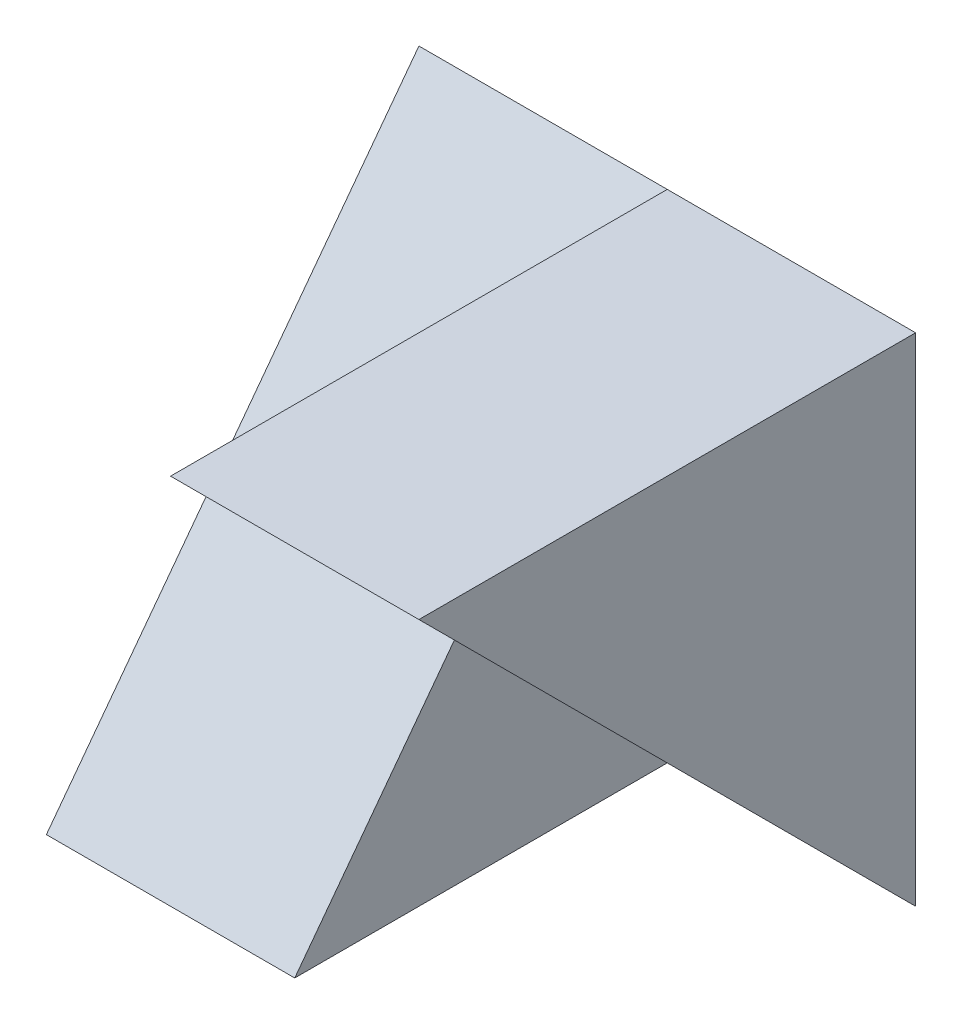
ISO-10303-21;
HEADER;
FILE_DESCRIPTION(('STEP AP214'),'2;1');
FILE_NAME('part.step','',(''),(''),'','','');
FILE_SCHEMA(('AUTOMOTIVE_DESIGN { 1 0 10303 214 1 1 1 1 }'));
ENDSEC;
DATA;
#1=APPLICATION_CONTEXT('core data for automotive mechanical design processes');
#2=APPLICATION_PROTOCOL_DEFINITION('international standard','automotive_design',2000,#1);
#3=PRODUCT_CONTEXT('',#1,'mechanical');
#4=PRODUCT('Part','Part','',(#3));
#5=PRODUCT_RELATED_PRODUCT_CATEGORY('part','',(#4));
#6=PRODUCT_DEFINITION_FORMATION('','',#4);
#7=PRODUCT_DEFINITION_CONTEXT('part definition',#1,'design');
#8=PRODUCT_DEFINITION('design','',#6,#7);
#9=PRODUCT_DEFINITION_SHAPE('','',#8);
#10=(LENGTH_UNIT() NAMED_UNIT(*) SI_UNIT(.MILLI.,.METRE.));
#11=(NAMED_UNIT(*) PLANE_ANGLE_UNIT() SI_UNIT($,.RADIAN.));
#12=(NAMED_UNIT(*) SI_UNIT($,.STERADIAN.) SOLID_ANGLE_UNIT());
#13=UNCERTAINTY_MEASURE_WITH_UNIT(LENGTH_MEASURE(1.E-05),#10,'distance_accuracy_value','');
#14=(GEOMETRIC_REPRESENTATION_CONTEXT(3) GLOBAL_UNCERTAINTY_ASSIGNED_CONTEXT((#13)) GLOBAL_UNIT_ASSIGNED_CONTEXT((#10,
#11,#12)) REPRESENTATION_CONTEXT('',''));
#15=CARTESIAN_POINT('',(0.,0.,0.));
#16=DIRECTION('',(0.,0.,1.));
#17=DIRECTION('',(1.,0.,0.));
#18=AXIS2_PLACEMENT_3D('',#15,#16,#17);
#19=CARTESIAN_POINT('',(2.,4.,0.));
#20=DIRECTION('',(0.,-1.,0.));
#21=DIRECTION('',(0.,0.,-1.));
#22=AXIS2_PLACEMENT_3D('',#19,#20,#21);
#23=PLANE('',#22);
#24=DIRECTION('',(-1.,0.,0.));
#25=VECTOR('',#24,1.);
#26=CARTESIAN_POINT('',(2.,4.,-4.));
#27=LINE('',#26,#25);
#28=CARTESIAN_POINT('',(2.,4.,-4.));
#29=VERTEX_POINT('',#28);
#30=CARTESIAN_POINT('',(0.,4.,-4.));
#31=VERTEX_POINT('',#30);
#32=EDGE_CURVE('E108',#29,#31,#27,.T.);
#33=ORIENTED_EDGE('',*,*,#32,.T.);
#34=DIRECTION('',(0.,0.,1.));
#35=VECTOR('',#34,1.);
#36=CARTESIAN_POINT('',(0.,4.,0.));
#37=LINE('',#36,#35);
#38=CARTESIAN_POINT('',(0.,4.,0.));
#39=VERTEX_POINT('',#38);
#40=EDGE_CURVE('E88',#31,#39,#37,.T.);
#41=ORIENTED_EDGE('',*,*,#40,.T.);
#42=DIRECTION('',(-1.,0.,0.));
#43=VECTOR('',#42,1.);
#44=CARTESIAN_POINT('',(2.,4.,0.));
#45=LINE('',#44,#43);
#46=CARTESIAN_POINT('',(2.,4.,0.));
#47=VERTEX_POINT('',#46);
#48=EDGE_CURVE('E115',#47,#39,#45,.T.);
#49=ORIENTED_EDGE('',*,*,#48,.F.);
#50=DIRECTION('',(0.,0.,1.));
#51=VECTOR('',#50,1.);
#52=CARTESIAN_POINT('',(2.,4.,0.));
#53=LINE('',#52,#51);
#54=EDGE_CURVE('E114',#29,#47,#53,.T.);
#55=ORIENTED_EDGE('',*,*,#54,.F.);
#56=EDGE_LOOP('',(#33,#41,#49,#55));
#57=FACE_BOUND('',#56,.T.);
#58=ADVANCED_FACE('F33',(#57),#23,.F.);
#59=CARTESIAN_POINT('',(2.,0.,0.));
#60=DIRECTION('',(0.,1.,0.));
#61=DIRECTION('',(0.,0.,1.));
#62=AXIS2_PLACEMENT_3D('',#59,#60,#61);
#63=PLANE('',#62);
#64=DIRECTION('',(0.,0.,-1.));
#65=VECTOR('',#64,1.);
#66=CARTESIAN_POINT('',(0.,0.,0.));
#67=LINE('',#66,#65);
#68=CARTESIAN_POINT('',(0.,0.,-1.));
#69=VERTEX_POINT('',#68);
#70=CARTESIAN_POINT('',(0.,0.,-4.));
#71=VERTEX_POINT('',#70);
#72=EDGE_CURVE('E129',#69,#71,#67,.T.);
#73=ORIENTED_EDGE('',*,*,#72,.F.);
#74=DIRECTION('',(1.,0.,0.));
#75=VECTOR('',#74,1.);
#76=CARTESIAN_POINT('',(-2.,0.,-1.));
#77=LINE('',#76,#75);
#78=CARTESIAN_POINT('',(-2.,0.,-1.));
#79=VERTEX_POINT('',#78);
#80=EDGE_CURVE('E96',#79,#69,#77,.T.);
#81=ORIENTED_EDGE('',*,*,#80,.F.);
#82=DIRECTION('',(0.,0.,1.));
#83=VECTOR('',#82,1.);
#84=CARTESIAN_POINT('',(-2.,0.,-4.));
#85=LINE('',#84,#83);
#86=CARTESIAN_POINT('',(-2.,0.,-4.));
#87=VERTEX_POINT('',#86);
#88=EDGE_CURVE('E125',#87,#79,#85,.T.);
#89=ORIENTED_EDGE('',*,*,#88,.F.);
#90=DIRECTION('',(-1.,0.,0.));
#91=VECTOR('',#90,1.);
#92=CARTESIAN_POINT('',(2.,0.,-4.));
#93=LINE('',#92,#91);
#94=EDGE_CURVE('E43',#71,#87,#93,.T.);
#95=ORIENTED_EDGE('',*,*,#94,.F.);
#96=EDGE_LOOP('',(#73,#81,#89,#95));
#97=FACE_BOUND('',#96,.T.);
#98=ADVANCED_FACE('F35',(#97),#63,.F.);
#99=CARTESIAN_POINT('',(2.,0.,-4.));
#100=DIRECTION('',(0.,0.,1.));
#101=DIRECTION('',(1.,0.,0.));
#102=AXIS2_PLACEMENT_3D('',#99,#100,#101);
#103=PLANE('',#102);
#104=CARTESIAN_POINT('',(2.,0.,-4.));
#105=VERTEX_POINT('',#104);
#106=EDGE_CURVE('E11',#105,#71,#93,.T.);
#107=ORIENTED_EDGE('',*,*,#106,.T.);
#108=ORIENTED_EDGE('',*,*,#94,.T.);
#109=DIRECTION('',(0.,-1.,0.));
#110=VECTOR('',#109,1.);
#111=CARTESIAN_POINT('',(-2.,4.,-4.));
#112=LINE('',#111,#110);
#113=CARTESIAN_POINT('',(-2.,4.,-4.));
#114=VERTEX_POINT('',#113);
#115=EDGE_CURVE('E111',#114,#87,#112,.T.);
#116=ORIENTED_EDGE('',*,*,#115,.F.);
#117=DIRECTION('',(-1.,0.,0.));
#118=VECTOR('',#117,1.);
#119=CARTESIAN_POINT('',(0.,4.,-4.));
#120=LINE('',#119,#118);
#121=EDGE_CURVE('E101',#31,#114,#120,.T.);
#122=ORIENTED_EDGE('',*,*,#121,.F.);
#123=ORIENTED_EDGE('',*,*,#32,.F.);
#124=DIRECTION('',(0.,1.,0.));
#125=VECTOR('',#124,1.);
#126=CARTESIAN_POINT('',(2.,0.,-4.));
#127=LINE('',#126,#125);
#128=EDGE_CURVE('E59',#105,#29,#127,.T.);
#129=ORIENTED_EDGE('',*,*,#128,.F.);
#130=EDGE_LOOP('',(#107,#108,#116,#122,#123,#129));
#131=FACE_BOUND('',#130,.T.);
#132=ADVANCED_FACE('F107',(#131),#103,.F.);
#133=CARTESIAN_POINT('',(2.,0.,0.));
#134=DIRECTION('',(-1.,0.,0.));
#135=DIRECTION('',(0.,0.,1.));
#136=AXIS2_PLACEMENT_3D('',#133,#134,#135);
#137=PLANE('',#136);
#138=ORIENTED_EDGE('',*,*,#54,.T.);
#139=DIRECTION('',(0.,0.707106781186544,0.707106781186551));
#140=VECTOR('',#139,1.);
#141=CARTESIAN_POINT('',(2.,2.,-1.99999999999998));
#142=LINE('',#141,#140);
#143=EDGE_CURVE('E112',#105,#47,#142,.T.);
#144=ORIENTED_EDGE('',*,*,#143,.F.);
#145=ORIENTED_EDGE('',*,*,#128,.T.);
#146=EDGE_LOOP('',(#138,#144,#145));
#147=FACE_BOUND('',#146,.T.);
#148=ADVANCED_FACE('F156',(#147),#137,.F.);
#149=CARTESIAN_POINT('',(0.,0.,0.));
#150=DIRECTION('',(-1.,0.,0.));
#151=DIRECTION('',(0.,0.,1.));
#152=AXIS2_PLACEMENT_3D('',#149,#150,#151);
#153=PLANE('',#152);
#154=DIRECTION('',(0.,0.707106781186544,0.707106781186551));
#155=VECTOR('',#154,1.);
#156=CARTESIAN_POINT('',(0.,2.,-1.99999999999998));
#157=LINE('',#156,#155);
#158=CARTESIAN_POINT('',(0.,1.7142857142857,-2.28571428571428));
#159=VERTEX_POINT('',#158);
#160=EDGE_CURVE('E51',#159,#39,#157,.T.);
#161=ORIENTED_EDGE('',*,*,#160,.T.);
#162=ORIENTED_EDGE('',*,*,#40,.F.);
#163=DIRECTION('',(0.,-0.8,0.6));
#164=VECTOR('',#163,1.);
#165=CARTESIAN_POINT('',(0.,0.,-1.));
#166=LINE('',#165,#164);
#167=EDGE_CURVE('E91',#31,#159,#166,.T.);
#168=ORIENTED_EDGE('',*,*,#167,.T.);
#169=EDGE_LOOP('',(#161,#162,#168));
#170=FACE_BOUND('',#169,.T.);
#171=ADVANCED_FACE('F90',(#170),#153,.T.);
#172=CARTESIAN_POINT('',(-2.,0.,0.));
#173=DIRECTION('',(-1.,0.,0.));
#174=DIRECTION('',(0.,0.,1.));
#175=AXIS2_PLACEMENT_3D('',#172,#173,#174);
#176=PLANE('',#175);
#177=DIRECTION('',(0.,-0.8,0.6));
#178=VECTOR('',#177,1.);
#179=CARTESIAN_POINT('',(-2.,0.,-1.));
#180=LINE('',#179,#178);
#181=EDGE_CURVE('E145',#114,#79,#180,.T.);
#182=ORIENTED_EDGE('',*,*,#181,.F.);
#183=ORIENTED_EDGE('',*,*,#115,.T.);
#184=ORIENTED_EDGE('',*,*,#88,.T.);
#185=EDGE_LOOP('',(#182,#183,#184));
#186=FACE_BOUND('',#185,.T.);
#187=ADVANCED_FACE('F144',(#186),#176,.T.);
#188=CARTESIAN_POINT('',(0.,0.,0.));
#189=DIRECTION('',(1.,0.,0.));
#190=DIRECTION('',(0.,0.,-1.));
#191=AXIS2_PLACEMENT_3D('',#188,#189,#190);
#192=PLANE('',#191);
#193=EDGE_CURVE('E37',#159,#69,#166,.T.);
#194=ORIENTED_EDGE('',*,*,#193,.T.);
#195=ORIENTED_EDGE('',*,*,#72,.T.);
#196=EDGE_CURVE('E128',#71,#159,#157,.T.);
#197=ORIENTED_EDGE('',*,*,#196,.T.);
#198=EDGE_LOOP('',(#194,#195,#197));
#199=FACE_BOUND('',#198,.T.);
#200=ADVANCED_FACE('F136',(#199),#192,.T.);
#201=CARTESIAN_POINT('',(0.,2.,-1.99999999999998));
#202=DIRECTION('',(0.,0.707106781186551,-0.707106781186544));
#203=DIRECTION('',(0.,0.707106781186544,0.707106781186551));
#204=AXIS2_PLACEMENT_3D('',#201,#202,#203);
#205=PLANE('',#204);
#206=ORIENTED_EDGE('',*,*,#143,.T.);
#207=ORIENTED_EDGE('',*,*,#48,.T.);
#208=ORIENTED_EDGE('',*,*,#160,.F.);
#209=ORIENTED_EDGE('',*,*,#196,.F.);
#210=ORIENTED_EDGE('',*,*,#106,.F.);
#211=EDGE_LOOP('',(#206,#207,#208,#209,#210));
#212=FACE_BOUND('',#211,.T.);
#213=ADVANCED_FACE('F139',(#212),#205,.F.);
#214=CARTESIAN_POINT('',(0.,0.,-1.));
#215=DIRECTION('',(0.,-0.6,-0.8));
#216=DIRECTION('',(0.,0.8,-0.6));
#217=AXIS2_PLACEMENT_3D('',#214,#215,#216);
#218=PLANE('',#217);
#219=ORIENTED_EDGE('',*,*,#181,.T.);
#220=ORIENTED_EDGE('',*,*,#80,.T.);
#221=ORIENTED_EDGE('',*,*,#193,.F.);
#222=ORIENTED_EDGE('',*,*,#167,.F.);
#223=ORIENTED_EDGE('',*,*,#121,.T.);
#224=EDGE_LOOP('',(#219,#220,#221,#222,#223));
#225=FACE_BOUND('',#224,.T.);
#226=ADVANCED_FACE('F100',(#225),#218,.F.);
#227=CLOSED_SHELL('',(#58,#98,#132,#148,#171,#187,#200,#213,#226));
#228=MANIFOLD_SOLID_BREP('B2',#227);
#229=ADVANCED_BREP_SHAPE_REPRESENTATION('',(#18,#228),#14);
#230=SHAPE_DEFINITION_REPRESENTATION(#9,#229);
ENDSEC;
END-ISO-10303-21;
